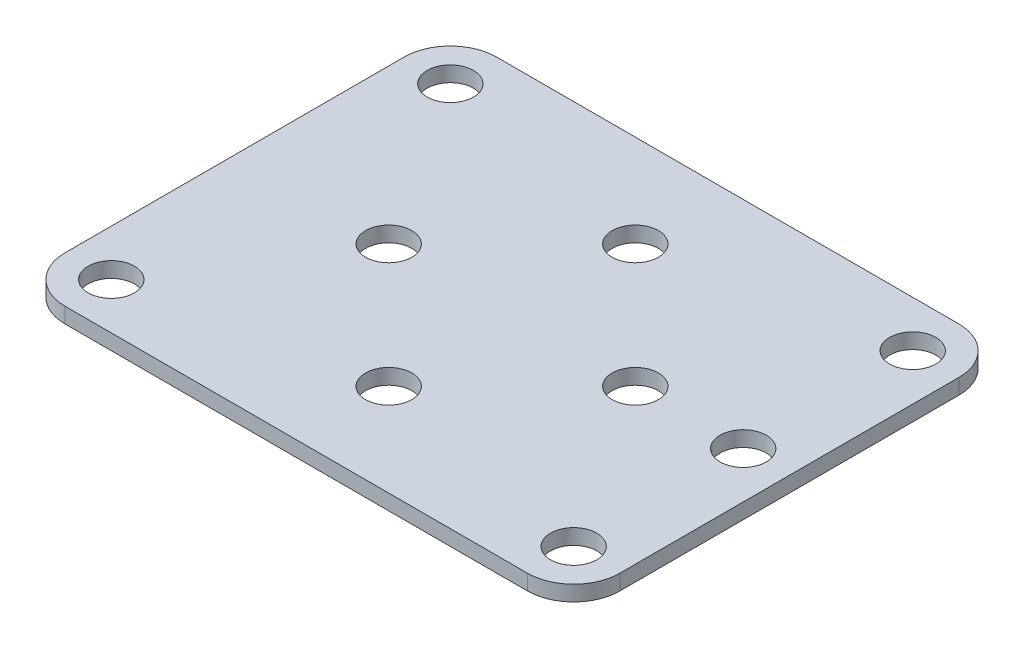
ISO-10303-21;
HEADER;
FILE_DESCRIPTION(('STEP AP214'),'2;1');
FILE_NAME('part.step','',(''),(''),'','','');
FILE_SCHEMA(('AUTOMOTIVE_DESIGN { 1 0 10303 214 1 1 1 1 }'));
ENDSEC;
DATA;
#1=APPLICATION_CONTEXT('core data for automotive mechanical design processes');
#2=APPLICATION_PROTOCOL_DEFINITION('international standard','automotive_design',2000,#1);
#3=PRODUCT_CONTEXT('',#1,'mechanical');
#4=PRODUCT('Part','Part','',(#3));
#5=PRODUCT_RELATED_PRODUCT_CATEGORY('part','',(#4));
#6=PRODUCT_DEFINITION_FORMATION('','',#4);
#7=PRODUCT_DEFINITION_CONTEXT('part definition',#1,'design');
#8=PRODUCT_DEFINITION('design','',#6,#7);
#9=PRODUCT_DEFINITION_SHAPE('','',#8);
#10=(LENGTH_UNIT() NAMED_UNIT(*) SI_UNIT(.MILLI.,.METRE.));
#11=(NAMED_UNIT(*) PLANE_ANGLE_UNIT() SI_UNIT($,.RADIAN.));
#12=(NAMED_UNIT(*) SI_UNIT($,.STERADIAN.) SOLID_ANGLE_UNIT());
#13=UNCERTAINTY_MEASURE_WITH_UNIT(LENGTH_MEASURE(1.E-05),#10,'distance_accuracy_value','');
#14=(GEOMETRIC_REPRESENTATION_CONTEXT(3) GLOBAL_UNCERTAINTY_ASSIGNED_CONTEXT((#13)) GLOBAL_UNIT_ASSIGNED_CONTEXT((#10,
#11,#12)) REPRESENTATION_CONTEXT('',''));
#15=CARTESIAN_POINT('',(0.,0.,0.));
#16=DIRECTION('',(0.,0.,1.));
#17=DIRECTION('',(1.,0.,0.));
#18=AXIS2_PLACEMENT_3D('',#15,#16,#17);
#19=CARTESIAN_POINT('',(3.,1.,-3.));
#20=DIRECTION('',(0.,1.,0.));
#21=DIRECTION('',(0.,0.,1.));
#22=AXIS2_PLACEMENT_3D('',#19,#20,#21);
#23=PLANE('',#22);
#24=CARTESIAN_POINT('',(33.,1.,-14.));
#25=DIRECTION('',(0.,1.,0.));
#26=DIRECTION('',(0.,0.,1.));
#27=AXIS2_PLACEMENT_3D('',#24,#25,#26);
#28=CIRCLE('',#27,1.5);
#29=CARTESIAN_POINT('',(33.,1.,-12.5));
#30=VERTEX_POINT('',#29);
#31=EDGE_CURVE('E228',#30,#30,#28,.T.);
#32=ORIENTED_EDGE('',*,*,#31,.F.);
#33=EDGE_LOOP('',(#32));
#34=FACE_BOUND('',#33,.T.);
#35=CARTESIAN_POINT('',(26.,1.,-14.));
#36=DIRECTION('',(0.,1.,0.));
#37=DIRECTION('',(0.,0.,1.));
#38=AXIS2_PLACEMENT_3D('',#35,#36,#37);
#39=CIRCLE('',#38,1.5);
#40=CARTESIAN_POINT('',(26.,1.,-12.5));
#41=VERTEX_POINT('',#40);
#42=EDGE_CURVE('E214',#41,#41,#39,.T.);
#43=ORIENTED_EDGE('',*,*,#42,.F.);
#44=EDGE_LOOP('',(#43));
#45=FACE_BOUND('',#44,.T.);
#46=CARTESIAN_POINT('',(18.,1.,-22.));
#47=DIRECTION('',(0.,1.,0.));
#48=DIRECTION('',(0.,0.,1.));
#49=AXIS2_PLACEMENT_3D('',#46,#47,#48);
#50=CIRCLE('',#49,1.5);
#51=CARTESIAN_POINT('',(18.,1.,-20.5));
#52=VERTEX_POINT('',#51);
#53=EDGE_CURVE('E202',#52,#52,#50,.T.);
#54=ORIENTED_EDGE('',*,*,#53,.F.);
#55=EDGE_LOOP('',(#54));
#56=FACE_BOUND('',#55,.T.);
#57=CARTESIAN_POINT('',(33.,1.,-25.));
#58=DIRECTION('',(0.,1.,0.));
#59=DIRECTION('',(0.,0.,1.));
#60=AXIS2_PLACEMENT_3D('',#57,#58,#59);
#61=CIRCLE('',#60,1.5);
#62=CARTESIAN_POINT('',(33.,1.,-23.5));
#63=VERTEX_POINT('',#62);
#64=EDGE_CURVE('E190',#63,#63,#61,.T.);
#65=ORIENTED_EDGE('',*,*,#64,.F.);
#66=EDGE_LOOP('',(#65));
#67=FACE_BOUND('',#66,.T.);
#68=CARTESIAN_POINT('',(3.,1.,-25.));
#69=DIRECTION('',(0.,1.,0.));
#70=DIRECTION('',(0.,0.,1.));
#71=AXIS2_PLACEMENT_3D('',#68,#69,#70);
#72=CIRCLE('',#71,1.5);
#73=CARTESIAN_POINT('',(3.,1.,-23.5));
#74=VERTEX_POINT('',#73);
#75=EDGE_CURVE('E135',#74,#74,#72,.T.);
#76=ORIENTED_EDGE('',*,*,#75,.F.);
#77=EDGE_LOOP('',(#76));
#78=FACE_BOUND('',#77,.T.);
#79=CARTESIAN_POINT('',(3.,1.,-3.));
#80=DIRECTION('',(0.,1.,0.));
#81=DIRECTION('',(0.,0.,1.));
#82=AXIS2_PLACEMENT_3D('',#79,#80,#81);
#83=CIRCLE('',#82,3.);
#84=CARTESIAN_POINT('',(0.,1.,-3.00000000000002));
#85=VERTEX_POINT('',#84);
#86=CARTESIAN_POINT('',(3.00000000000002,1.,0.));
#87=VERTEX_POINT('',#86);
#88=EDGE_CURVE('E146',#85,#87,#83,.T.);
#89=ORIENTED_EDGE('',*,*,#88,.T.);
#90=DIRECTION('',(1.,0.,0.));
#91=VECTOR('',#90,1.);
#92=CARTESIAN_POINT('',(3.00000000000002,1.,0.));
#93=LINE('',#92,#91);
#94=CARTESIAN_POINT('',(33.,1.,0.));
#95=VERTEX_POINT('',#94);
#96=EDGE_CURVE('E94',#87,#95,#93,.T.);
#97=ORIENTED_EDGE('',*,*,#96,.T.);
#98=CARTESIAN_POINT('',(33.,1.,-3.));
#99=DIRECTION('',(0.,1.,0.));
#100=DIRECTION('',(0.,0.,1.));
#101=AXIS2_PLACEMENT_3D('',#98,#99,#100);
#102=CIRCLE('',#101,3.);
#103=CARTESIAN_POINT('',(36.,1.,-3.00000000000002));
#104=VERTEX_POINT('',#103);
#105=EDGE_CURVE('E162',#95,#104,#102,.T.);
#106=ORIENTED_EDGE('',*,*,#105,.T.);
#107=DIRECTION('',(0.,0.,-1.));
#108=VECTOR('',#107,1.);
#109=CARTESIAN_POINT('',(36.,1.,-3.00000000000002));
#110=LINE('',#109,#108);
#111=CARTESIAN_POINT('',(36.,1.,-25.));
#112=VERTEX_POINT('',#111);
#113=EDGE_CURVE('E175',#104,#112,#110,.T.);
#114=ORIENTED_EDGE('',*,*,#113,.T.);
#115=CARTESIAN_POINT('',(33.,1.,-25.));
#116=DIRECTION('',(0.,1.,0.));
#117=DIRECTION('',(0.,0.,1.));
#118=AXIS2_PLACEMENT_3D('',#115,#116,#117);
#119=CIRCLE('',#118,3.);
#120=CARTESIAN_POINT('',(33.,1.,-28.));
#121=VERTEX_POINT('',#120);
#122=EDGE_CURVE('E113',#112,#121,#119,.T.);
#123=ORIENTED_EDGE('',*,*,#122,.T.);
#124=DIRECTION('',(-1.,0.,0.));
#125=VECTOR('',#124,1.);
#126=CARTESIAN_POINT('',(3.00000000000002,1.,-28.));
#127=LINE('',#126,#125);
#128=CARTESIAN_POINT('',(3.,1.,-28.));
#129=VERTEX_POINT('',#128);
#130=EDGE_CURVE('E107',#121,#129,#127,.T.);
#131=ORIENTED_EDGE('',*,*,#130,.T.);
#132=CARTESIAN_POINT('',(3.,1.,-25.));
#133=DIRECTION('',(0.,1.,0.));
#134=DIRECTION('',(0.,0.,-1.));
#135=AXIS2_PLACEMENT_3D('',#132,#133,#134);
#136=CIRCLE('',#135,3.);
#137=CARTESIAN_POINT('',(0.,1.,-25.));
#138=VERTEX_POINT('',#137);
#139=EDGE_CURVE('E111',#129,#138,#136,.T.);
#140=ORIENTED_EDGE('',*,*,#139,.T.);
#141=DIRECTION('',(0.,0.,1.));
#142=VECTOR('',#141,1.);
#143=CARTESIAN_POINT('',(0.,1.,-3.00000000000002));
#144=LINE('',#143,#142);
#145=EDGE_CURVE('E51',#138,#85,#144,.T.);
#146=ORIENTED_EDGE('',*,*,#145,.T.);
#147=EDGE_LOOP('',(#89,#97,#106,#114,#123,#131,#140,#146));
#148=FACE_BOUND('',#147,.T.);
#149=CARTESIAN_POINT('',(3.,1.,-3.));
#150=DIRECTION('',(0.,1.,0.));
#151=DIRECTION('',(0.,0.,1.));
#152=AXIS2_PLACEMENT_3D('',#149,#150,#151);
#153=CIRCLE('',#152,1.5);
#154=CARTESIAN_POINT('',(3.,1.,-1.5));
#155=VERTEX_POINT('',#154);
#156=EDGE_CURVE('E184',#155,#155,#153,.T.);
#157=ORIENTED_EDGE('',*,*,#156,.F.);
#158=EDGE_LOOP('',(#157));
#159=FACE_BOUND('',#158,.T.);
#160=CARTESIAN_POINT('',(33.,1.,-3.));
#161=DIRECTION('',(0.,1.,0.));
#162=DIRECTION('',(0.,0.,1.));
#163=AXIS2_PLACEMENT_3D('',#160,#161,#162);
#164=CIRCLE('',#163,1.5);
#165=CARTESIAN_POINT('',(33.,1.,-1.5));
#166=VERTEX_POINT('',#165);
#167=EDGE_CURVE('E196',#166,#166,#164,.T.);
#168=ORIENTED_EDGE('',*,*,#167,.F.);
#169=EDGE_LOOP('',(#168));
#170=FACE_BOUND('',#169,.T.);
#171=CARTESIAN_POINT('',(18.,1.,-6.00000000000001));
#172=DIRECTION('',(0.,1.,0.));
#173=DIRECTION('',(0.,0.,-1.));
#174=AXIS2_PLACEMENT_3D('',#171,#172,#173);
#175=CIRCLE('',#174,1.5);
#176=CARTESIAN_POINT('',(18.,1.,-7.50000000000001));
#177=VERTEX_POINT('',#176);
#178=EDGE_CURVE('E208',#177,#177,#175,.T.);
#179=ORIENTED_EDGE('',*,*,#178,.F.);
#180=EDGE_LOOP('',(#179));
#181=FACE_BOUND('',#180,.T.);
#182=CARTESIAN_POINT('',(10.,1.,-14.));
#183=DIRECTION('',(0.,1.,0.));
#184=DIRECTION('',(0.,0.,-1.));
#185=AXIS2_PLACEMENT_3D('',#182,#183,#184);
#186=CIRCLE('',#185,1.5);
#187=CARTESIAN_POINT('',(10.,1.,-15.5));
#188=VERTEX_POINT('',#187);
#189=EDGE_CURVE('E220',#188,#188,#186,.T.);
#190=ORIENTED_EDGE('',*,*,#189,.F.);
#191=EDGE_LOOP('',(#190));
#192=FACE_BOUND('',#191,.T.);
#193=ADVANCED_FACE('F33',(#34,#45,#56,#67,#78,#148,#159,#170,#181,#192),#23,.T.);
#194=CARTESIAN_POINT('',(3.,0.,-3.));
#195=DIRECTION('',(0.,1.,0.));
#196=DIRECTION('',(0.,0.,1.));
#197=AXIS2_PLACEMENT_3D('',#194,#195,#196);
#198=PLANE('',#197);
#199=CARTESIAN_POINT('',(33.,0.,-14.));
#200=DIRECTION('',(0.,1.,0.));
#201=DIRECTION('',(0.,0.,1.));
#202=AXIS2_PLACEMENT_3D('',#199,#200,#201);
#203=CIRCLE('',#202,1.5);
#204=CARTESIAN_POINT('',(33.,0.,-12.5));
#205=VERTEX_POINT('',#204);
#206=EDGE_CURVE('E37',#205,#205,#203,.T.);
#207=ORIENTED_EDGE('',*,*,#206,.T.);
#208=EDGE_LOOP('',(#207));
#209=FACE_BOUND('',#208,.T.);
#210=CARTESIAN_POINT('',(3.,0.,-3.));
#211=DIRECTION('',(0.,1.,0.));
#212=DIRECTION('',(0.,0.,1.));
#213=AXIS2_PLACEMENT_3D('',#210,#211,#212);
#214=CIRCLE('',#213,3.);
#215=CARTESIAN_POINT('',(0.,0.,-3.00000000000002));
#216=VERTEX_POINT('',#215);
#217=CARTESIAN_POINT('',(3.00000000000002,0.,0.));
#218=VERTEX_POINT('',#217);
#219=EDGE_CURVE('E131',#216,#218,#214,.T.);
#220=ORIENTED_EDGE('',*,*,#219,.F.);
#221=DIRECTION('',(0.,0.,1.));
#222=VECTOR('',#221,1.);
#223=CARTESIAN_POINT('',(0.,0.,-3.00000000000002));
#224=LINE('',#223,#222);
#225=CARTESIAN_POINT('',(0.,0.,-25.));
#226=VERTEX_POINT('',#225);
#227=EDGE_CURVE('E86',#226,#216,#224,.T.);
#228=ORIENTED_EDGE('',*,*,#227,.F.);
#229=CARTESIAN_POINT('',(3.,0.,-25.));
#230=DIRECTION('',(0.,1.,0.));
#231=DIRECTION('',(0.,0.,-1.));
#232=AXIS2_PLACEMENT_3D('',#229,#230,#231);
#233=CIRCLE('',#232,3.);
#234=CARTESIAN_POINT('',(3.,0.,-28.));
#235=VERTEX_POINT('',#234);
#236=EDGE_CURVE('E80',#235,#226,#233,.T.);
#237=ORIENTED_EDGE('',*,*,#236,.F.);
#238=DIRECTION('',(-1.,0.,0.));
#239=VECTOR('',#238,1.);
#240=CARTESIAN_POINT('',(3.00000000000002,0.,-28.));
#241=LINE('',#240,#239);
#242=CARTESIAN_POINT('',(33.,0.,-28.));
#243=VERTEX_POINT('',#242);
#244=EDGE_CURVE('E121',#243,#235,#241,.T.);
#245=ORIENTED_EDGE('',*,*,#244,.F.);
#246=CARTESIAN_POINT('',(33.,0.,-25.));
#247=DIRECTION('',(0.,1.,0.));
#248=DIRECTION('',(0.,0.,1.));
#249=AXIS2_PLACEMENT_3D('',#246,#247,#248);
#250=CIRCLE('',#249,3.);
#251=CARTESIAN_POINT('',(36.,0.,-25.));
#252=VERTEX_POINT('',#251);
#253=EDGE_CURVE('E141',#252,#243,#250,.T.);
#254=ORIENTED_EDGE('',*,*,#253,.F.);
#255=DIRECTION('',(0.,0.,-1.));
#256=VECTOR('',#255,1.);
#257=CARTESIAN_POINT('',(36.,0.,-3.00000000000002));
#258=LINE('',#257,#256);
#259=CARTESIAN_POINT('',(36.,0.,-3.00000000000002));
#260=VERTEX_POINT('',#259);
#261=EDGE_CURVE('E139',#260,#252,#258,.T.);
#262=ORIENTED_EDGE('',*,*,#261,.F.);
#263=CARTESIAN_POINT('',(33.,0.,-3.));
#264=DIRECTION('',(0.,1.,0.));
#265=DIRECTION('',(0.,0.,1.));
#266=AXIS2_PLACEMENT_3D('',#263,#264,#265);
#267=CIRCLE('',#266,3.);
#268=CARTESIAN_POINT('',(33.,0.,0.));
#269=VERTEX_POINT('',#268);
#270=EDGE_CURVE('E137',#269,#260,#267,.T.);
#271=ORIENTED_EDGE('',*,*,#270,.F.);
#272=DIRECTION('',(1.,0.,0.));
#273=VECTOR('',#272,1.);
#274=CARTESIAN_POINT('',(3.00000000000002,0.,0.));
#275=LINE('',#274,#273);
#276=EDGE_CURVE('E134',#218,#269,#275,.T.);
#277=ORIENTED_EDGE('',*,*,#276,.F.);
#278=EDGE_LOOP('',(#220,#228,#237,#245,#254,#262,#271,#277));
#279=FACE_BOUND('',#278,.T.);
#280=CARTESIAN_POINT('',(3.,0.,-25.));
#281=DIRECTION('',(0.,1.,0.));
#282=DIRECTION('',(0.,0.,1.));
#283=AXIS2_PLACEMENT_3D('',#280,#281,#282);
#284=CIRCLE('',#283,1.5);
#285=CARTESIAN_POINT('',(3.,0.,-23.5));
#286=VERTEX_POINT('',#285);
#287=EDGE_CURVE('E181',#286,#286,#284,.T.);
#288=ORIENTED_EDGE('',*,*,#287,.T.);
#289=EDGE_LOOP('',(#288));
#290=FACE_BOUND('',#289,.T.);
#291=CARTESIAN_POINT('',(3.,0.,-3.));
#292=DIRECTION('',(0.,1.,0.));
#293=DIRECTION('',(0.,0.,1.));
#294=AXIS2_PLACEMENT_3D('',#291,#292,#293);
#295=CIRCLE('',#294,1.5);
#296=CARTESIAN_POINT('',(3.,0.,-1.5));
#297=VERTEX_POINT('',#296);
#298=EDGE_CURVE('E187',#297,#297,#295,.T.);
#299=ORIENTED_EDGE('',*,*,#298,.T.);
#300=EDGE_LOOP('',(#299));
#301=FACE_BOUND('',#300,.T.);
#302=CARTESIAN_POINT('',(33.,0.,-25.));
#303=DIRECTION('',(0.,1.,0.));
#304=DIRECTION('',(0.,0.,1.));
#305=AXIS2_PLACEMENT_3D('',#302,#303,#304);
#306=CIRCLE('',#305,1.5);
#307=CARTESIAN_POINT('',(33.,0.,-23.5));
#308=VERTEX_POINT('',#307);
#309=EDGE_CURVE('E193',#308,#308,#306,.T.);
#310=ORIENTED_EDGE('',*,*,#309,.T.);
#311=EDGE_LOOP('',(#310));
#312=FACE_BOUND('',#311,.T.);
#313=CARTESIAN_POINT('',(33.,0.,-3.));
#314=DIRECTION('',(0.,1.,0.));
#315=DIRECTION('',(0.,0.,1.));
#316=AXIS2_PLACEMENT_3D('',#313,#314,#315);
#317=CIRCLE('',#316,1.5);
#318=CARTESIAN_POINT('',(33.,0.,-1.5));
#319=VERTEX_POINT('',#318);
#320=EDGE_CURVE('E199',#319,#319,#317,.T.);
#321=ORIENTED_EDGE('',*,*,#320,.T.);
#322=EDGE_LOOP('',(#321));
#323=FACE_BOUND('',#322,.T.);
#324=CARTESIAN_POINT('',(18.,0.,-22.));
#325=DIRECTION('',(0.,1.,0.));
#326=DIRECTION('',(0.,0.,1.));
#327=AXIS2_PLACEMENT_3D('',#324,#325,#326);
#328=CIRCLE('',#327,1.5);
#329=CARTESIAN_POINT('',(18.,0.,-20.5));
#330=VERTEX_POINT('',#329);
#331=EDGE_CURVE('E205',#330,#330,#328,.T.);
#332=ORIENTED_EDGE('',*,*,#331,.T.);
#333=EDGE_LOOP('',(#332));
#334=FACE_BOUND('',#333,.T.);
#335=CARTESIAN_POINT('',(18.,0.,-6.00000000000001));
#336=DIRECTION('',(0.,1.,0.));
#337=DIRECTION('',(0.,0.,-1.));
#338=AXIS2_PLACEMENT_3D('',#335,#336,#337);
#339=CIRCLE('',#338,1.5);
#340=CARTESIAN_POINT('',(18.,0.,-7.50000000000001));
#341=VERTEX_POINT('',#340);
#342=EDGE_CURVE('E211',#341,#341,#339,.T.);
#343=ORIENTED_EDGE('',*,*,#342,.T.);
#344=EDGE_LOOP('',(#343));
#345=FACE_BOUND('',#344,.T.);
#346=CARTESIAN_POINT('',(26.,0.,-14.));
#347=DIRECTION('',(0.,1.,0.));
#348=DIRECTION('',(0.,0.,1.));
#349=AXIS2_PLACEMENT_3D('',#346,#347,#348);
#350=CIRCLE('',#349,1.5);
#351=CARTESIAN_POINT('',(26.,0.,-12.5));
#352=VERTEX_POINT('',#351);
#353=EDGE_CURVE('E217',#352,#352,#350,.T.);
#354=ORIENTED_EDGE('',*,*,#353,.T.);
#355=EDGE_LOOP('',(#354));
#356=FACE_BOUND('',#355,.T.);
#357=CARTESIAN_POINT('',(10.,0.,-14.));
#358=DIRECTION('',(0.,1.,0.));
#359=DIRECTION('',(0.,0.,-1.));
#360=AXIS2_PLACEMENT_3D('',#357,#358,#359);
#361=CIRCLE('',#360,1.5);
#362=CARTESIAN_POINT('',(10.,0.,-15.5));
#363=VERTEX_POINT('',#362);
#364=EDGE_CURVE('E223',#363,#363,#361,.T.);
#365=ORIENTED_EDGE('',*,*,#364,.T.);
#366=EDGE_LOOP('',(#365));
#367=FACE_BOUND('',#366,.T.);
#368=ADVANCED_FACE('F166',(#209,#279,#290,#301,#312,#323,#334,#345,#356,#367),#198,.F.);
#369=CARTESIAN_POINT('',(3.,1.,-3.));
#370=DIRECTION('',(0.,-1.,0.));
#371=DIRECTION('',(0.,0.,-1.));
#372=AXIS2_PLACEMENT_3D('',#369,#370,#371);
#373=CYLINDRICAL_SURFACE('',#372,3.);
#374=ORIENTED_EDGE('',*,*,#219,.T.);
#375=DIRECTION('',(0.,-1.,0.));
#376=VECTOR('',#375,1.);
#377=CARTESIAN_POINT('',(3.00000000000002,1.,0.));
#378=LINE('',#377,#376);
#379=EDGE_CURVE('E11',#87,#218,#378,.T.);
#380=ORIENTED_EDGE('',*,*,#379,.F.);
#381=ORIENTED_EDGE('',*,*,#88,.F.);
#382=DIRECTION('',(0.,-1.,0.));
#383=VECTOR('',#382,1.);
#384=CARTESIAN_POINT('',(0.,1.,-3.00000000000002));
#385=LINE('',#384,#383);
#386=EDGE_CURVE('E127',#85,#216,#385,.T.);
#387=ORIENTED_EDGE('',*,*,#386,.T.);
#388=EDGE_LOOP('',(#374,#380,#381,#387));
#389=FACE_BOUND('',#388,.T.);
#390=ADVANCED_FACE('F35',(#389),#373,.T.);
#391=CARTESIAN_POINT('',(3.00000000000002,1.,0.));
#392=DIRECTION('',(0.,0.,-1.));
#393=DIRECTION('',(-1.,0.,0.));
#394=AXIS2_PLACEMENT_3D('',#391,#392,#393);
#395=PLANE('',#394);
#396=ORIENTED_EDGE('',*,*,#276,.T.);
#397=DIRECTION('',(0.,-1.,0.));
#398=VECTOR('',#397,1.);
#399=CARTESIAN_POINT('',(33.,1.,0.));
#400=LINE('',#399,#398);
#401=EDGE_CURVE('E43',#95,#269,#400,.T.);
#402=ORIENTED_EDGE('',*,*,#401,.F.);
#403=ORIENTED_EDGE('',*,*,#96,.F.);
#404=ORIENTED_EDGE('',*,*,#379,.T.);
#405=EDGE_LOOP('',(#396,#402,#403,#404));
#406=FACE_BOUND('',#405,.T.);
#407=ADVANCED_FACE('F270',(#406),#395,.F.);
#408=CARTESIAN_POINT('',(33.,1.,-3.));
#409=DIRECTION('',(0.,-1.,0.));
#410=DIRECTION('',(0.,0.,-1.));
#411=AXIS2_PLACEMENT_3D('',#408,#409,#410);
#412=CYLINDRICAL_SURFACE('',#411,3.);
#413=ORIENTED_EDGE('',*,*,#270,.T.);
#414=DIRECTION('',(0.,-1.,0.));
#415=VECTOR('',#414,1.);
#416=CARTESIAN_POINT('',(36.,1.,-3.00000000000002));
#417=LINE('',#416,#415);
#418=EDGE_CURVE('E153',#104,#260,#417,.T.);
#419=ORIENTED_EDGE('',*,*,#418,.F.);
#420=ORIENTED_EDGE('',*,*,#105,.F.);
#421=ORIENTED_EDGE('',*,*,#401,.T.);
#422=EDGE_LOOP('',(#413,#419,#420,#421));
#423=FACE_BOUND('',#422,.T.);
#424=ADVANCED_FACE('F160',(#423),#412,.T.);
#425=CARTESIAN_POINT('',(36.,1.,-3.00000000000002));
#426=DIRECTION('',(-1.,0.,0.));
#427=DIRECTION('',(0.,0.,1.));
#428=AXIS2_PLACEMENT_3D('',#425,#426,#427);
#429=PLANE('',#428);
#430=ORIENTED_EDGE('',*,*,#261,.T.);
#431=DIRECTION('',(0.,-1.,0.));
#432=VECTOR('',#431,1.);
#433=CARTESIAN_POINT('',(36.,1.,-25.));
#434=LINE('',#433,#432);
#435=EDGE_CURVE('E150',#112,#252,#434,.T.);
#436=ORIENTED_EDGE('',*,*,#435,.F.);
#437=ORIENTED_EDGE('',*,*,#113,.F.);
#438=ORIENTED_EDGE('',*,*,#418,.T.);
#439=EDGE_LOOP('',(#430,#436,#437,#438));
#440=FACE_BOUND('',#439,.T.);
#441=ADVANCED_FACE('F171',(#440),#429,.F.);
#442=CARTESIAN_POINT('',(33.,1.,-25.));
#443=DIRECTION('',(0.,-1.,0.));
#444=DIRECTION('',(0.,0.,-1.));
#445=AXIS2_PLACEMENT_3D('',#442,#443,#444);
#446=CYLINDRICAL_SURFACE('',#445,3.);
#447=ORIENTED_EDGE('',*,*,#253,.T.);
#448=DIRECTION('',(0.,-1.,0.));
#449=VECTOR('',#448,1.);
#450=CARTESIAN_POINT('',(33.,1.,-28.));
#451=LINE('',#450,#449);
#452=EDGE_CURVE('E122',#121,#243,#451,.T.);
#453=ORIENTED_EDGE('',*,*,#452,.F.);
#454=ORIENTED_EDGE('',*,*,#122,.F.);
#455=ORIENTED_EDGE('',*,*,#435,.T.);
#456=EDGE_LOOP('',(#447,#453,#454,#455));
#457=FACE_BOUND('',#456,.T.);
#458=ADVANCED_FACE('F174',(#457),#446,.T.);
#459=CARTESIAN_POINT('',(3.00000000000002,1.,-28.));
#460=DIRECTION('',(0.,0.,1.));
#461=DIRECTION('',(1.,0.,0.));
#462=AXIS2_PLACEMENT_3D('',#459,#460,#461);
#463=PLANE('',#462);
#464=ORIENTED_EDGE('',*,*,#244,.T.);
#465=DIRECTION('',(0.,-1.,0.));
#466=VECTOR('',#465,1.);
#467=CARTESIAN_POINT('',(3.,1.,-28.));
#468=LINE('',#467,#466);
#469=EDGE_CURVE('E118',#129,#235,#468,.T.);
#470=ORIENTED_EDGE('',*,*,#469,.F.);
#471=ORIENTED_EDGE('',*,*,#130,.F.);
#472=ORIENTED_EDGE('',*,*,#452,.T.);
#473=EDGE_LOOP('',(#464,#470,#471,#472));
#474=FACE_BOUND('',#473,.T.);
#475=ADVANCED_FACE('F119',(#474),#463,.F.);
#476=CARTESIAN_POINT('',(3.,1.,-25.));
#477=DIRECTION('',(0.,-1.,0.));
#478=DIRECTION('',(0.,0.,-1.));
#479=AXIS2_PLACEMENT_3D('',#476,#477,#478);
#480=CYLINDRICAL_SURFACE('',#479,3.);
#481=ORIENTED_EDGE('',*,*,#236,.T.);
#482=DIRECTION('',(0.,-1.,0.));
#483=VECTOR('',#482,1.);
#484=CARTESIAN_POINT('',(0.,1.,-25.));
#485=LINE('',#484,#483);
#486=EDGE_CURVE('E123',#138,#226,#485,.T.);
#487=ORIENTED_EDGE('',*,*,#486,.F.);
#488=ORIENTED_EDGE('',*,*,#139,.F.);
#489=ORIENTED_EDGE('',*,*,#469,.T.);
#490=EDGE_LOOP('',(#481,#487,#488,#489));
#491=FACE_BOUND('',#490,.T.);
#492=ADVANCED_FACE('F125',(#491),#480,.T.);
#493=CARTESIAN_POINT('',(0.,1.,-3.00000000000002));
#494=DIRECTION('',(1.,0.,0.));
#495=DIRECTION('',(0.,0.,-1.));
#496=AXIS2_PLACEMENT_3D('',#493,#494,#495);
#497=PLANE('',#496);
#498=ORIENTED_EDGE('',*,*,#227,.T.);
#499=ORIENTED_EDGE('',*,*,#386,.F.);
#500=ORIENTED_EDGE('',*,*,#145,.F.);
#501=ORIENTED_EDGE('',*,*,#486,.T.);
#502=EDGE_LOOP('',(#498,#499,#500,#501));
#503=FACE_BOUND('',#502,.T.);
#504=ADVANCED_FACE('F258',(#503),#497,.F.);
#505=CARTESIAN_POINT('',(3.,1.,-25.));
#506=DIRECTION('',(0.,-1.,0.));
#507=DIRECTION('',(0.,0.,-1.));
#508=AXIS2_PLACEMENT_3D('',#505,#506,#507);
#509=CYLINDRICAL_SURFACE('',#508,1.5);
#510=ORIENTED_EDGE('',*,*,#75,.T.);
#511=EDGE_LOOP('',(#510));
#512=FACE_BOUND('',#511,.T.);
#513=ORIENTED_EDGE('',*,*,#287,.F.);
#514=EDGE_LOOP('',(#513));
#515=FACE_BOUND('',#514,.T.);
#516=ADVANCED_FACE('F255',(#512,#515),#509,.F.);
#517=CARTESIAN_POINT('',(3.,1.,-3.));
#518=DIRECTION('',(0.,-1.,0.));
#519=DIRECTION('',(0.,0.,-1.));
#520=AXIS2_PLACEMENT_3D('',#517,#518,#519);
#521=CYLINDRICAL_SURFACE('',#520,1.5);
#522=ORIENTED_EDGE('',*,*,#156,.T.);
#523=EDGE_LOOP('',(#522));
#524=FACE_BOUND('',#523,.T.);
#525=ORIENTED_EDGE('',*,*,#298,.F.);
#526=EDGE_LOOP('',(#525));
#527=FACE_BOUND('',#526,.T.);
#528=ADVANCED_FACE('F341',(#524,#527),#521,.F.);
#529=CARTESIAN_POINT('',(33.,1.,-25.));
#530=DIRECTION('',(0.,-1.,0.));
#531=DIRECTION('',(0.,0.,-1.));
#532=AXIS2_PLACEMENT_3D('',#529,#530,#531);
#533=CYLINDRICAL_SURFACE('',#532,1.5);
#534=ORIENTED_EDGE('',*,*,#64,.T.);
#535=EDGE_LOOP('',(#534));
#536=FACE_BOUND('',#535,.T.);
#537=ORIENTED_EDGE('',*,*,#309,.F.);
#538=EDGE_LOOP('',(#537));
#539=FACE_BOUND('',#538,.T.);
#540=ADVANCED_FACE('F332',(#536,#539),#533,.F.);
#541=CARTESIAN_POINT('',(33.,1.,-3.));
#542=DIRECTION('',(0.,-1.,0.));
#543=DIRECTION('',(0.,0.,-1.));
#544=AXIS2_PLACEMENT_3D('',#541,#542,#543);
#545=CYLINDRICAL_SURFACE('',#544,1.5);
#546=ORIENTED_EDGE('',*,*,#167,.T.);
#547=EDGE_LOOP('',(#546));
#548=FACE_BOUND('',#547,.T.);
#549=ORIENTED_EDGE('',*,*,#320,.F.);
#550=EDGE_LOOP('',(#549));
#551=FACE_BOUND('',#550,.T.);
#552=ADVANCED_FACE('F323',(#548,#551),#545,.F.);
#553=CARTESIAN_POINT('',(18.,1.,-22.));
#554=DIRECTION('',(0.,-1.,0.));
#555=DIRECTION('',(0.,0.,-1.));
#556=AXIS2_PLACEMENT_3D('',#553,#554,#555);
#557=CYLINDRICAL_SURFACE('',#556,1.5);
#558=ORIENTED_EDGE('',*,*,#53,.T.);
#559=EDGE_LOOP('',(#558));
#560=FACE_BOUND('',#559,.T.);
#561=ORIENTED_EDGE('',*,*,#331,.F.);
#562=EDGE_LOOP('',(#561));
#563=FACE_BOUND('',#562,.T.);
#564=ADVANCED_FACE('F314',(#560,#563),#557,.F.);
#565=CARTESIAN_POINT('',(18.,1.,-6.00000000000001));
#566=DIRECTION('',(0.,-1.,0.));
#567=DIRECTION('',(0.,0.,-1.));
#568=AXIS2_PLACEMENT_3D('',#565,#566,#567);
#569=CYLINDRICAL_SURFACE('',#568,1.5);
#570=ORIENTED_EDGE('',*,*,#178,.T.);
#571=EDGE_LOOP('',(#570));
#572=FACE_BOUND('',#571,.T.);
#573=ORIENTED_EDGE('',*,*,#342,.F.);
#574=EDGE_LOOP('',(#573));
#575=FACE_BOUND('',#574,.T.);
#576=ADVANCED_FACE('F305',(#572,#575),#569,.F.);
#577=CARTESIAN_POINT('',(26.,1.,-14.));
#578=DIRECTION('',(0.,-1.,0.));
#579=DIRECTION('',(0.,0.,-1.));
#580=AXIS2_PLACEMENT_3D('',#577,#578,#579);
#581=CYLINDRICAL_SURFACE('',#580,1.5);
#582=ORIENTED_EDGE('',*,*,#42,.T.);
#583=EDGE_LOOP('',(#582));
#584=FACE_BOUND('',#583,.T.);
#585=ORIENTED_EDGE('',*,*,#353,.F.);
#586=EDGE_LOOP('',(#585));
#587=FACE_BOUND('',#586,.T.);
#588=ADVANCED_FACE('F243',(#584,#587),#581,.F.);
#589=CARTESIAN_POINT('',(10.,1.,-14.));
#590=DIRECTION('',(0.,-1.,0.));
#591=DIRECTION('',(0.,0.,-1.));
#592=AXIS2_PLACEMENT_3D('',#589,#590,#591);
#593=CYLINDRICAL_SURFACE('',#592,1.5);
#594=ORIENTED_EDGE('',*,*,#189,.T.);
#595=EDGE_LOOP('',(#594));
#596=FACE_BOUND('',#595,.T.);
#597=ORIENTED_EDGE('',*,*,#364,.F.);
#598=EDGE_LOOP('',(#597));
#599=FACE_BOUND('',#598,.T.);
#600=ADVANCED_FACE('F238',(#596,#599),#593,.F.);
#601=CARTESIAN_POINT('',(33.,-9.,-14.));
#602=DIRECTION('',(0.,1.,0.));
#603=DIRECTION('',(0.,0.,1.));
#604=AXIS2_PLACEMENT_3D('',#601,#602,#603);
#605=CYLINDRICAL_SURFACE('',#604,1.5);
#606=ORIENTED_EDGE('',*,*,#31,.T.);
#607=EDGE_LOOP('',(#606));
#608=FACE_BOUND('',#607,.T.);
#609=ORIENTED_EDGE('',*,*,#206,.F.);
#610=EDGE_LOOP('',(#609));
#611=FACE_BOUND('',#610,.T.);
#612=ADVANCED_FACE('F236',(#608,#611),#605,.F.);
#613=CLOSED_SHELL('',(#193,#368,#390,#407,#424,#441,#458,#475,#492,#504,#516,#528,#540,#552,
#564,#576,#588,#600,#612));
#614=MANIFOLD_SOLID_BREP('B2',#613);
#615=ADVANCED_BREP_SHAPE_REPRESENTATION('',(#18,#614),#14);
#616=SHAPE_DEFINITION_REPRESENTATION(#9,#615);
ENDSEC;
END-ISO-10303-21;
